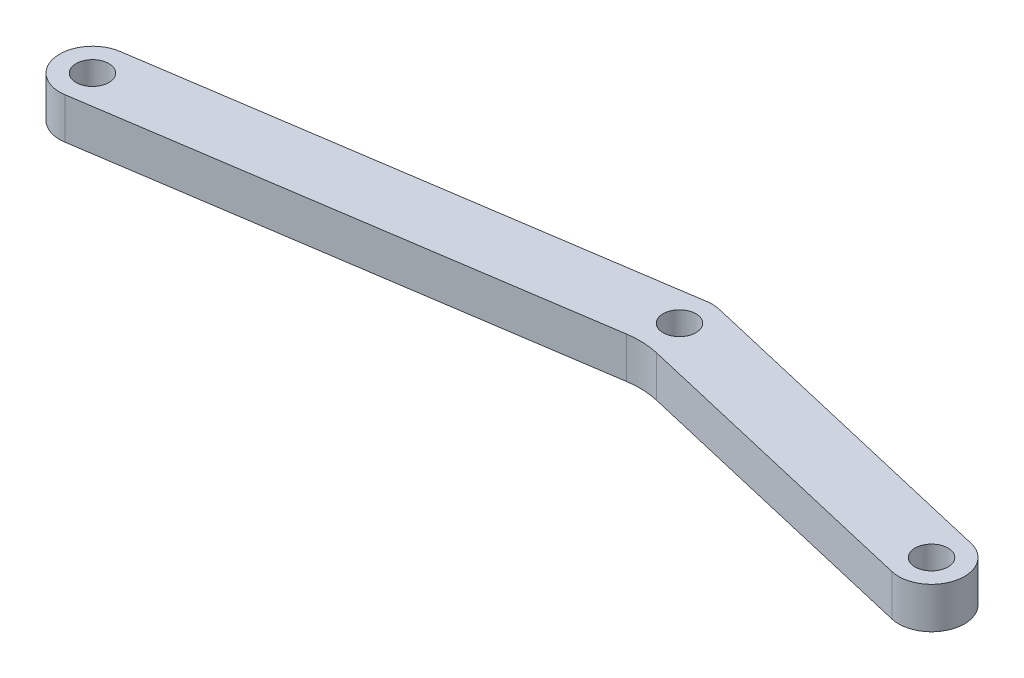
ISO-10303-21;
HEADER;
FILE_DESCRIPTION(('STEP AP214'),'2;1');
FILE_NAME('part.step','',(''),(''),'','','');
FILE_SCHEMA(('AUTOMOTIVE_DESIGN { 1 0 10303 214 1 1 1 1 }'));
ENDSEC;
DATA;
#1=APPLICATION_CONTEXT('core data for automotive mechanical design processes');
#2=APPLICATION_PROTOCOL_DEFINITION('international standard','automotive_design',2000,#1);
#3=PRODUCT_CONTEXT('',#1,'mechanical');
#4=PRODUCT('Part','Part','',(#3));
#5=PRODUCT_RELATED_PRODUCT_CATEGORY('part','',(#4));
#6=PRODUCT_DEFINITION_FORMATION('','',#4);
#7=PRODUCT_DEFINITION_CONTEXT('part definition',#1,'design');
#8=PRODUCT_DEFINITION('design','',#6,#7);
#9=PRODUCT_DEFINITION_SHAPE('','',#8);
#10=(LENGTH_UNIT() NAMED_UNIT(*) SI_UNIT(.MILLI.,.METRE.));
#11=(NAMED_UNIT(*) PLANE_ANGLE_UNIT() SI_UNIT($,.RADIAN.));
#12=(NAMED_UNIT(*) SI_UNIT($,.STERADIAN.) SOLID_ANGLE_UNIT());
#13=UNCERTAINTY_MEASURE_WITH_UNIT(LENGTH_MEASURE(1.E-05),#10,'distance_accuracy_value','');
#14=(GEOMETRIC_REPRESENTATION_CONTEXT(3) GLOBAL_UNCERTAINTY_ASSIGNED_CONTEXT((#13)) GLOBAL_UNIT_ASSIGNED_CONTEXT((#10,
#11,#12)) REPRESENTATION_CONTEXT('',''));
#15=CARTESIAN_POINT('',(0.,0.,0.));
#16=DIRECTION('',(0.,0.,1.));
#17=DIRECTION('',(1.,0.,0.));
#18=AXIS2_PLACEMENT_3D('',#15,#16,#17);
#19=CARTESIAN_POINT('',(3.55128148598873,5.,-15.1991503787235));
#20=DIRECTION('',(0.227522045071205,0.,-0.973772929900301));
#21=DIRECTION('',(-0.973772929900301,0.,-0.227522045071205));
#22=AXIS2_PLACEMENT_3D('',#19,#20,#21);
#23=PLANE('',#22);
#24=DIRECTION('',(0.973772929900301,0.,0.227522045071205));
#25=VECTOR('',#24,1.);
#26=CARTESIAN_POINT('',(3.55128148598873,0.,-15.1991503787235));
#27=LINE('',#26,#25);
#28=CARTESIAN_POINT('',(11.9315881802848,0.,-13.2410917196012));
#29=VERTEX_POINT('',#28);
#30=CARTESIAN_POINT('',(51.9315881802848,0.,-3.89509171960122));
#31=VERTEX_POINT('',#30);
#32=EDGE_CURVE('E106',#29,#31,#27,.T.);
#33=ORIENTED_EDGE('',*,*,#32,.F.);
#34=DIRECTION('',(0.,-1.,0.));
#35=VECTOR('',#34,1.);
#36=CARTESIAN_POINT('',(11.9315881802848,5.,-13.2410917196012));
#37=LINE('',#36,#35);
#38=CARTESIAN_POINT('',(11.9315881802848,5.,-13.2410917196012));
#39=VERTEX_POINT('',#38);
#40=EDGE_CURVE('E101',#39,#29,#37,.T.);
#41=ORIENTED_EDGE('',*,*,#40,.F.);
#42=DIRECTION('',(0.973772929900301,0.,0.227522045071205));
#43=VECTOR('',#42,1.);
#44=CARTESIAN_POINT('',(3.55128148598873,5.,-15.1991503787235));
#45=LINE('',#44,#43);
#46=CARTESIAN_POINT('',(51.9315881802848,5.,-3.89509171960122));
#47=VERTEX_POINT('',#46);
#48=EDGE_CURVE('E104',#39,#47,#45,.T.);
#49=ORIENTED_EDGE('',*,*,#48,.T.);
#50=DIRECTION('',(0.,-1.,0.));
#51=VECTOR('',#50,1.);
#52=CARTESIAN_POINT('',(51.9315881802848,5.,-3.89509171960122));
#53=LINE('',#52,#51);
#54=EDGE_CURVE('E149',#47,#31,#53,.T.);
#55=ORIENTED_EDGE('',*,*,#54,.T.);
#56=EDGE_LOOP('',(#33,#41,#49,#55));
#57=FACE_BOUND('',#56,.T.);
#58=ADVANCED_FACE('F36',(#57),#23,.T.);
#59=CARTESIAN_POINT('',(11.0215,5.,-9.346));
#60=DIRECTION('',(0.,-1.,0.));
#61=DIRECTION('',(0.,0.,-1.));
#62=AXIS2_PLACEMENT_3D('',#59,#60,#61);
#63=CYLINDRICAL_SURFACE('',#62,4.);
#64=CARTESIAN_POINT('',(11.0215,0.,-9.346));
#65=DIRECTION('',(0.,1.,0.));
#66=DIRECTION('',(0.,0.,1.));
#67=AXIS2_PLACEMENT_3D('',#64,#65,#66);
#68=CIRCLE('',#67,4.);
#69=CARTESIAN_POINT('',(10.4256723890405,0.,-13.3013747556987));
#70=VERTEX_POINT('',#69);
#71=EDGE_CURVE('E151',#29,#70,#68,.T.);
#72=ORIENTED_EDGE('',*,*,#71,.T.);
#73=DIRECTION('',(0.,-1.,0.));
#74=VECTOR('',#73,1.);
#75=CARTESIAN_POINT('',(10.4256723890405,5.,-13.3013747556987));
#76=LINE('',#75,#74);
#77=CARTESIAN_POINT('',(10.4256723890405,5.,-13.3013747556987));
#78=VERTEX_POINT('',#77);
#79=EDGE_CURVE('E111',#78,#70,#76,.T.);
#80=ORIENTED_EDGE('',*,*,#79,.F.);
#81=CARTESIAN_POINT('',(11.0215,5.,-9.346));
#82=DIRECTION('',(0.,1.,0.));
#83=DIRECTION('',(0.,0.,1.));
#84=AXIS2_PLACEMENT_3D('',#81,#82,#83);
#85=CIRCLE('',#84,4.);
#86=EDGE_CURVE('E114',#39,#78,#85,.T.);
#87=ORIENTED_EDGE('',*,*,#86,.F.);
#88=ORIENTED_EDGE('',*,*,#40,.T.);
#89=EDGE_LOOP('',(#72,#80,#87,#88));
#90=FACE_BOUND('',#89,.T.);
#91=ADVANCED_FACE('F115',(#90),#63,.T.);
#92=CARTESIAN_POINT('',(-1.72790075894193,5.,-11.4705913532029));
#93=DIRECTION('',(-0.148956902739873,0.,-0.988843688924667));
#94=DIRECTION('',(-0.988843688924667,0.,0.148956902739873));
#95=AXIS2_PLACEMENT_3D('',#92,#93,#94);
#96=PLANE('',#95);
#97=DIRECTION('',(0.988843688924667,0.,-0.148956902739873));
#98=VECTOR('',#97,1.);
#99=CARTESIAN_POINT('',(-1.72790075894193,0.,-11.4705913532029));
#100=LINE('',#99,#98);
#101=CARTESIAN_POINT('',(-51.6173276109595,0.,-3.95537475569867));
#102=VERTEX_POINT('',#101);
#103=EDGE_CURVE('E153',#102,#70,#100,.T.);
#104=ORIENTED_EDGE('',*,*,#103,.F.);
#105=DIRECTION('',(0.,-1.,0.));
#106=VECTOR('',#105,1.);
#107=CARTESIAN_POINT('',(-51.6173276109595,5.,-3.95537475569867));
#108=LINE('',#107,#106);
#109=CARTESIAN_POINT('',(-51.6173276109595,5.,-3.95537475569867));
#110=VERTEX_POINT('',#109);
#111=EDGE_CURVE('E177',#110,#102,#108,.T.);
#112=ORIENTED_EDGE('',*,*,#111,.F.);
#113=DIRECTION('',(0.988843688924667,0.,-0.148956902739873));
#114=VECTOR('',#113,1.);
#115=CARTESIAN_POINT('',(-1.72790075894193,5.,-11.4705913532029));
#116=LINE('',#115,#114);
#117=EDGE_CURVE('E119',#110,#78,#116,.T.);
#118=ORIENTED_EDGE('',*,*,#117,.T.);
#119=ORIENTED_EDGE('',*,*,#79,.T.);
#120=EDGE_LOOP('',(#104,#112,#118,#119));
#121=FACE_BOUND('',#120,.T.);
#122=ADVANCED_FACE('F212',(#121),#96,.T.);
#123=CARTESIAN_POINT('',(-51.0215,5.,0.));
#124=DIRECTION('',(0.,-1.,0.));
#125=DIRECTION('',(0.,0.,-1.));
#126=AXIS2_PLACEMENT_3D('',#123,#124,#125);
#127=CYLINDRICAL_SURFACE('',#126,4.);
#128=CARTESIAN_POINT('',(-51.0215,0.,0.));
#129=DIRECTION('',(0.,1.,0.));
#130=DIRECTION('',(0.,0.,1.));
#131=AXIS2_PLACEMENT_3D('',#128,#129,#130);
#132=CIRCLE('',#131,4.);
#133=CARTESIAN_POINT('',(-50.4256723890405,0.,3.95537475569867));
#134=VERTEX_POINT('',#133);
#135=EDGE_CURVE('E156',#102,#134,#132,.T.);
#136=ORIENTED_EDGE('',*,*,#135,.T.);
#137=DIRECTION('',(0.,-1.,0.));
#138=VECTOR('',#137,1.);
#139=CARTESIAN_POINT('',(-50.4256723890405,5.,3.95537475569867));
#140=LINE('',#139,#138);
#141=CARTESIAN_POINT('',(-50.4256723890405,5.,3.95537475569867));
#142=VERTEX_POINT('',#141);
#143=EDGE_CURVE('E174',#142,#134,#140,.T.);
#144=ORIENTED_EDGE('',*,*,#143,.F.);
#145=CARTESIAN_POINT('',(-51.0215,5.,0.));
#146=DIRECTION('',(0.,1.,0.));
#147=DIRECTION('',(0.,0.,1.));
#148=AXIS2_PLACEMENT_3D('',#145,#146,#147);
#149=CIRCLE('',#148,4.);
#150=EDGE_CURVE('E133',#110,#142,#149,.T.);
#151=ORIENTED_EDGE('',*,*,#150,.F.);
#152=ORIENTED_EDGE('',*,*,#111,.T.);
#153=EDGE_LOOP('',(#136,#144,#151,#152));
#154=FACE_BOUND('',#153,.T.);
#155=ADVANCED_FACE('F217',(#154),#127,.T.);
#156=CARTESIAN_POINT('',(-0.536245537022952,5.,-3.55984184180558));
#157=DIRECTION('',(-0.148956902739873,0.,-0.988843688924667));
#158=DIRECTION('',(-0.988843688924667,0.,0.148956902739873));
#159=AXIS2_PLACEMENT_3D('',#156,#157,#158);
#160=PLANE('',#159);
#161=DIRECTION('',(0.988843688924667,0.,-0.148956902739873));
#162=VECTOR('',#161,1.);
#163=CARTESIAN_POINT('',(-0.536245537022952,0.,-3.55984184180558));
#164=LINE('',#163,#162);
#165=CARTESIAN_POINT('',(8.96173833703183,0.,-4.99059401831085));
#166=VERTEX_POINT('',#165);
#167=EDGE_CURVE('E158',#134,#166,#164,.T.);
#168=ORIENTED_EDGE('',*,*,#167,.T.);
#169=DIRECTION('',(0.,-1.,0.));
#170=VECTOR('',#169,1.);
#171=CARTESIAN_POINT('',(8.96173833703182,5.,-4.99059401831084));
#172=LINE('',#171,#170);
#173=CARTESIAN_POINT('',(8.96173833703183,5.,-4.99059401831085));
#174=VERTEX_POINT('',#173);
#175=EDGE_CURVE('E51',#166,#174,#172,.F.);
#176=ORIENTED_EDGE('',*,*,#175,.T.);
#177=DIRECTION('',(0.988843688924667,0.,-0.148956902739873));
#178=VECTOR('',#177,1.);
#179=CARTESIAN_POINT('',(-0.536245537022952,5.,-3.55984184180558));
#180=LINE('',#179,#178);
#181=EDGE_CURVE('E135',#142,#174,#180,.T.);
#182=ORIENTED_EDGE('',*,*,#181,.F.);
#183=ORIENTED_EDGE('',*,*,#143,.T.);
#184=EDGE_LOOP('',(#168,#176,#182,#183));
#185=FACE_BOUND('',#184,.T.);
#186=ADVANCED_FACE('F221',(#185),#160,.F.);
#187=CARTESIAN_POINT('',(1.7311051254191,5.,-7.40896693952107));
#188=DIRECTION('',(0.227522045071205,0.,-0.973772929900301));
#189=DIRECTION('',(-0.973772929900301,0.,-0.227522045071205));
#190=AXIS2_PLACEMENT_3D('',#187,#188,#189);
#191=PLANE('',#190);
#192=DIRECTION('',(0.973772929900301,0.,0.227522045071205));
#193=VECTOR('',#192,1.);
#194=CARTESIAN_POINT('',(1.7311051254191,5.,-7.40896693952107));
#195=LINE('',#194,#193);
#196=CARTESIAN_POINT('',(12.7265278151426,5.,-4.83988642806718));
#197=VERTEX_POINT('',#196);
#198=CARTESIAN_POINT('',(50.1114118197152,5.,3.89509171960119));
#199=VERTEX_POINT('',#198);
#200=EDGE_CURVE('E137',#197,#199,#195,.T.);
#201=ORIENTED_EDGE('',*,*,#200,.F.);
#202=DIRECTION('',(0.,-1.,0.));
#203=VECTOR('',#202,1.);
#204=CARTESIAN_POINT('',(12.7265278151426,0.,-4.83988642806718));
#205=LINE('',#204,#203);
#206=CARTESIAN_POINT('',(12.7265278151426,0.,-4.83988642806718));
#207=VERTEX_POINT('',#206);
#208=EDGE_CURVE('E110',#197,#207,#205,.T.);
#209=ORIENTED_EDGE('',*,*,#208,.T.);
#210=DIRECTION('',(0.973772929900301,0.,0.227522045071205));
#211=VECTOR('',#210,1.);
#212=CARTESIAN_POINT('',(1.7311051254191,0.,-7.40896693952107));
#213=LINE('',#212,#211);
#214=CARTESIAN_POINT('',(50.1114118197152,0.,3.89509171960119));
#215=VERTEX_POINT('',#214);
#216=EDGE_CURVE('E160',#207,#215,#213,.T.);
#217=ORIENTED_EDGE('',*,*,#216,.T.);
#218=DIRECTION('',(0.,-1.,0.));
#219=VECTOR('',#218,1.);
#220=CARTESIAN_POINT('',(50.1114118197152,5.,3.89509171960119));
#221=LINE('',#220,#219);
#222=EDGE_CURVE('E171',#199,#215,#221,.T.);
#223=ORIENTED_EDGE('',*,*,#222,.F.);
#224=EDGE_LOOP('',(#201,#209,#217,#223));
#225=FACE_BOUND('',#224,.T.);
#226=ADVANCED_FACE('F185',(#225),#191,.F.);
#227=CARTESIAN_POINT('',(11.0215,5.,-9.346));
#228=DIRECTION('',(0.,-1.,0.));
#229=DIRECTION('',(0.,0.,-1.));
#230=AXIS2_PLACEMENT_3D('',#227,#228,#229);
#231=CYLINDRICAL_SURFACE('',#230,2.);
#232=CARTESIAN_POINT('',(11.0215,5.,-9.346));
#233=DIRECTION('',(0.,1.,0.));
#234=DIRECTION('',(0.,0.,1.));
#235=AXIS2_PLACEMENT_3D('',#232,#233,#234);
#236=CIRCLE('',#235,2.);
#237=CARTESIAN_POINT('',(11.0215,5.,-7.346));
#238=VERTEX_POINT('',#237);
#239=EDGE_CURVE('E143',#238,#238,#236,.T.);
#240=ORIENTED_EDGE('',*,*,#239,.T.);
#241=EDGE_LOOP('',(#240));
#242=FACE_BOUND('',#241,.T.);
#243=CARTESIAN_POINT('',(11.0215,0.,-9.346));
#244=DIRECTION('',(0.,1.,0.));
#245=DIRECTION('',(0.,0.,1.));
#246=AXIS2_PLACEMENT_3D('',#243,#244,#245);
#247=CIRCLE('',#246,2.);
#248=CARTESIAN_POINT('',(11.0215,0.,-7.346));
#249=VERTEX_POINT('',#248);
#250=EDGE_CURVE('E129',#249,#249,#247,.T.);
#251=ORIENTED_EDGE('',*,*,#250,.F.);
#252=EDGE_LOOP('',(#251));
#253=FACE_BOUND('',#252,.T.);
#254=ADVANCED_FACE('F204',(#242,#253),#231,.F.);
#255=CARTESIAN_POINT('',(-51.0215,5.,0.));
#256=DIRECTION('',(0.,-1.,0.));
#257=DIRECTION('',(0.,0.,-1.));
#258=AXIS2_PLACEMENT_3D('',#255,#256,#257);
#259=CYLINDRICAL_SURFACE('',#258,2.);
#260=CARTESIAN_POINT('',(-51.0215,5.,0.));
#261=DIRECTION('',(0.,1.,0.));
#262=DIRECTION('',(0.,0.,1.));
#263=AXIS2_PLACEMENT_3D('',#260,#261,#262);
#264=CIRCLE('',#263,2.);
#265=CARTESIAN_POINT('',(-51.0215,5.,2.));
#266=VERTEX_POINT('',#265);
#267=EDGE_CURVE('E140',#266,#266,#264,.T.);
#268=ORIENTED_EDGE('',*,*,#267,.T.);
#269=EDGE_LOOP('',(#268));
#270=FACE_BOUND('',#269,.T.);
#271=CARTESIAN_POINT('',(-51.0215,0.,0.));
#272=DIRECTION('',(0.,1.,0.));
#273=DIRECTION('',(0.,0.,1.));
#274=AXIS2_PLACEMENT_3D('',#271,#272,#273);
#275=CIRCLE('',#274,2.);
#276=CARTESIAN_POINT('',(-51.0215,0.,2.));
#277=VERTEX_POINT('',#276);
#278=EDGE_CURVE('E165',#277,#277,#275,.T.);
#279=ORIENTED_EDGE('',*,*,#278,.F.);
#280=EDGE_LOOP('',(#279));
#281=FACE_BOUND('',#280,.T.);
#282=ADVANCED_FACE('F196',(#270,#281),#259,.F.);
#283=CARTESIAN_POINT('',(51.0215,5.,0.));
#284=DIRECTION('',(0.,-1.,0.));
#285=DIRECTION('',(0.,0.,-1.));
#286=AXIS2_PLACEMENT_3D('',#283,#284,#285);
#287=CYLINDRICAL_SURFACE('',#286,4.);
#288=CARTESIAN_POINT('',(51.0215,0.,0.));
#289=DIRECTION('',(0.,1.,0.));
#290=DIRECTION('',(0.,0.,1.));
#291=AXIS2_PLACEMENT_3D('',#288,#289,#290);
#292=CIRCLE('',#291,4.);
#293=EDGE_CURVE('E162',#215,#31,#292,.T.);
#294=ORIENTED_EDGE('',*,*,#293,.T.);
#295=ORIENTED_EDGE('',*,*,#54,.F.);
#296=CARTESIAN_POINT('',(51.0215,5.,0.));
#297=DIRECTION('',(0.,1.,0.));
#298=DIRECTION('',(0.,0.,1.));
#299=AXIS2_PLACEMENT_3D('',#296,#297,#298);
#300=CIRCLE('',#299,4.);
#301=EDGE_CURVE('E124',#199,#47,#300,.T.);
#302=ORIENTED_EDGE('',*,*,#301,.F.);
#303=ORIENTED_EDGE('',*,*,#222,.T.);
#304=EDGE_LOOP('',(#294,#295,#302,#303));
#305=FACE_BOUND('',#304,.T.);
#306=ADVANCED_FACE('F193',(#305),#287,.T.);
#307=CARTESIAN_POINT('',(51.0215,5.,0.));
#308=DIRECTION('',(0.,-1.,0.));
#309=DIRECTION('',(0.,0.,-1.));
#310=AXIS2_PLACEMENT_3D('',#307,#308,#309);
#311=CYLINDRICAL_SURFACE('',#310,2.);
#312=CARTESIAN_POINT('',(51.0215,5.,0.));
#313=DIRECTION('',(0.,1.,0.));
#314=DIRECTION('',(0.,0.,1.));
#315=AXIS2_PLACEMENT_3D('',#312,#313,#314);
#316=CIRCLE('',#315,2.);
#317=CARTESIAN_POINT('',(51.0215,5.,1.99999999999998));
#318=VERTEX_POINT('',#317);
#319=EDGE_CURVE('E146',#318,#318,#316,.T.);
#320=ORIENTED_EDGE('',*,*,#319,.T.);
#321=EDGE_LOOP('',(#320));
#322=FACE_BOUND('',#321,.T.);
#323=CARTESIAN_POINT('',(51.0215,0.,0.));
#324=DIRECTION('',(0.,1.,0.));
#325=DIRECTION('',(0.,0.,1.));
#326=AXIS2_PLACEMENT_3D('',#323,#324,#325);
#327=CIRCLE('',#326,2.);
#328=CARTESIAN_POINT('',(51.0215,0.,1.99999999999998));
#329=VERTEX_POINT('',#328);
#330=EDGE_CURVE('E126',#329,#329,#327,.T.);
#331=ORIENTED_EDGE('',*,*,#330,.F.);
#332=EDGE_LOOP('',(#331));
#333=FACE_BOUND('',#332,.T.);
#334=ADVANCED_FACE('F195',(#322,#333),#311,.F.);
#335=CARTESIAN_POINT('',(0.,5.,0.));
#336=DIRECTION('',(0.,1.,0.));
#337=DIRECTION('',(0.,0.,1.));
#338=AXIS2_PLACEMENT_3D('',#335,#336,#337);
#339=PLANE('',#338);
#340=ORIENTED_EDGE('',*,*,#48,.F.);
#341=ORIENTED_EDGE('',*,*,#86,.T.);
#342=ORIENTED_EDGE('',*,*,#117,.F.);
#343=ORIENTED_EDGE('',*,*,#150,.T.);
#344=ORIENTED_EDGE('',*,*,#181,.T.);
#345=CARTESIAN_POINT('',(10.4513073644306,5.,4.89784287093583));
#346=DIRECTION('',(0.,1.,0.));
#347=DIRECTION('',(0.,0.,1.));
#348=AXIS2_PLACEMENT_3D('',#345,#346,#347);
#349=CIRCLE('',#348,10.);
#350=EDGE_CURVE('E11',#174,#197,#349,.F.);
#351=ORIENTED_EDGE('',*,*,#350,.T.);
#352=ORIENTED_EDGE('',*,*,#200,.T.);
#353=ORIENTED_EDGE('',*,*,#301,.T.);
#354=EDGE_LOOP('',(#340,#341,#342,#343,#344,#351,#352,#353));
#355=FACE_BOUND('',#354,.T.);
#356=ORIENTED_EDGE('',*,*,#267,.F.);
#357=EDGE_LOOP('',(#356));
#358=FACE_BOUND('',#357,.T.);
#359=ORIENTED_EDGE('',*,*,#239,.F.);
#360=EDGE_LOOP('',(#359));
#361=FACE_BOUND('',#360,.T.);
#362=ORIENTED_EDGE('',*,*,#319,.F.);
#363=EDGE_LOOP('',(#362));
#364=FACE_BOUND('',#363,.T.);
#365=ADVANCED_FACE('F121',(#355,#358,#361,#364),#339,.T.);
#366=CARTESIAN_POINT('',(0.,0.,0.));
#367=DIRECTION('',(0.,1.,0.));
#368=DIRECTION('',(0.,0.,1.));
#369=AXIS2_PLACEMENT_3D('',#366,#367,#368);
#370=PLANE('',#369);
#371=ORIENTED_EDGE('',*,*,#32,.T.);
#372=ORIENTED_EDGE('',*,*,#293,.F.);
#373=ORIENTED_EDGE('',*,*,#216,.F.);
#374=CARTESIAN_POINT('',(10.4513073644306,0.,4.89784287093583));
#375=DIRECTION('',(0.,1.,0.));
#376=DIRECTION('',(0.,0.,1.));
#377=AXIS2_PLACEMENT_3D('',#374,#375,#376);
#378=CIRCLE('',#377,10.);
#379=EDGE_CURVE('E44',#207,#166,#378,.T.);
#380=ORIENTED_EDGE('',*,*,#379,.T.);
#381=ORIENTED_EDGE('',*,*,#167,.F.);
#382=ORIENTED_EDGE('',*,*,#135,.F.);
#383=ORIENTED_EDGE('',*,*,#103,.T.);
#384=ORIENTED_EDGE('',*,*,#71,.F.);
#385=EDGE_LOOP('',(#371,#372,#373,#380,#381,#382,#383,#384));
#386=FACE_BOUND('',#385,.T.);
#387=ORIENTED_EDGE('',*,*,#278,.T.);
#388=EDGE_LOOP('',(#387));
#389=FACE_BOUND('',#388,.T.);
#390=ORIENTED_EDGE('',*,*,#250,.T.);
#391=EDGE_LOOP('',(#390));
#392=FACE_BOUND('',#391,.T.);
#393=ORIENTED_EDGE('',*,*,#330,.T.);
#394=EDGE_LOOP('',(#393));
#395=FACE_BOUND('',#394,.T.);
#396=ADVANCED_FACE('F190',(#386,#389,#392,#395),#370,.F.);
#397=CARTESIAN_POINT('',(10.4513073644306,5.,4.89784287093583));
#398=DIRECTION('',(0.,1.,0.));
#399=DIRECTION('',(0.,0.,1.));
#400=AXIS2_PLACEMENT_3D('',#397,#398,#399);
#401=CYLINDRICAL_SURFACE('',#400,10.);
#402=ORIENTED_EDGE('',*,*,#350,.F.);
#403=ORIENTED_EDGE('',*,*,#175,.F.);
#404=ORIENTED_EDGE('',*,*,#379,.F.);
#405=ORIENTED_EDGE('',*,*,#208,.F.);
#406=EDGE_LOOP('',(#402,#403,#404,#405));
#407=FACE_BOUND('',#406,.T.);
#408=ADVANCED_FACE('F38',(#407),#401,.F.);
#409=CLOSED_SHELL('',(#58,#91,#122,#155,#186,#226,#254,#282,#306,#334,#365,#396,#408));
#410=MANIFOLD_SOLID_BREP('B2',#409);
#411=ADVANCED_BREP_SHAPE_REPRESENTATION('',(#18,#410),#14);
#412=SHAPE_DEFINITION_REPRESENTATION(#9,#411);
ENDSEC;
END-ISO-10303-21;
